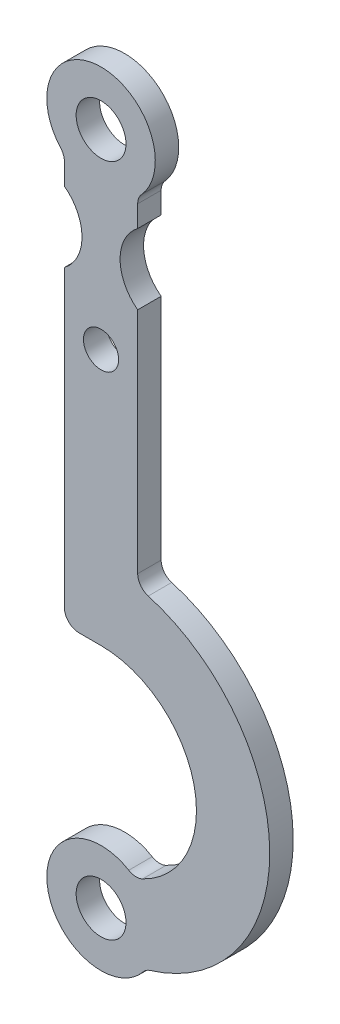
ISO-10303-21;
HEADER;
FILE_DESCRIPTION(('STEP AP214'),'2;1');
FILE_NAME('part.step','',(''),(''),'','','');
FILE_SCHEMA(('AUTOMOTIVE_DESIGN { 1 0 10303 214 1 1 1 1 }'));
ENDSEC;
DATA;
#1=APPLICATION_CONTEXT('core data for automotive mechanical design processes');
#2=APPLICATION_PROTOCOL_DEFINITION('international standard','automotive_design',2000,#1);
#3=PRODUCT_CONTEXT('',#1,'mechanical');
#4=PRODUCT('Part','Part','',(#3));
#5=PRODUCT_RELATED_PRODUCT_CATEGORY('part','',(#4));
#6=PRODUCT_DEFINITION_FORMATION('','',#4);
#7=PRODUCT_DEFINITION_CONTEXT('part definition',#1,'design');
#8=PRODUCT_DEFINITION('design','',#6,#7);
#9=PRODUCT_DEFINITION_SHAPE('','',#8);
#10=(LENGTH_UNIT() NAMED_UNIT(*) SI_UNIT(.MILLI.,.METRE.));
#11=(NAMED_UNIT(*) PLANE_ANGLE_UNIT() SI_UNIT($,.RADIAN.));
#12=(NAMED_UNIT(*) SI_UNIT($,.STERADIAN.) SOLID_ANGLE_UNIT());
#13=UNCERTAINTY_MEASURE_WITH_UNIT(LENGTH_MEASURE(1.E-05),#10,'distance_accuracy_value','');
#14=(GEOMETRIC_REPRESENTATION_CONTEXT(3) GLOBAL_UNCERTAINTY_ASSIGNED_CONTEXT((#13)) GLOBAL_UNIT_ASSIGNED_CONTEXT((#10,
#11,#12)) REPRESENTATION_CONTEXT('',''));
#15=CARTESIAN_POINT('',(0.,0.,0.));
#16=DIRECTION('',(0.,0.,1.));
#17=DIRECTION('',(1.,0.,0.));
#18=AXIS2_PLACEMENT_3D('',#15,#16,#17);
#19=CARTESIAN_POINT('',(0.,-230.,8.));
#20=DIRECTION('',(0.,0.,-1.));
#21=DIRECTION('',(-1.,0.,0.));
#22=AXIS2_PLACEMENT_3D('',#19,#20,#21);
#23=CYLINDRICAL_SURFACE('',#22,18.5);
#24=CARTESIAN_POINT('',(0.,-230.,0.));
#25=DIRECTION('',(0.,0.,1.));
#26=DIRECTION('',(1.,0.,0.));
#27=AXIS2_PLACEMENT_3D('',#24,#25,#26);
#28=CIRCLE('',#27,18.5);
#29=CARTESIAN_POINT('',(9.44463891587366,-214.092492472145,0.));
#30=VERTEX_POINT('',#29);
#31=CARTESIAN_POINT('',(14.3530284553606,-241.672213764304,0.));
#32=VERTEX_POINT('',#31);
#33=EDGE_CURVE('E236',#30,#32,#28,.T.);
#34=ORIENTED_EDGE('',*,*,#33,.T.);
#35=DIRECTION('',(0.,0.,-1.));
#36=VECTOR('',#35,1.);
#37=CARTESIAN_POINT('',(14.3530284553606,-241.672213764304,8.));
#38=LINE('',#37,#36);
#39=CARTESIAN_POINT('',(14.3530284553606,-241.672213764304,8.));
#40=VERTEX_POINT('',#39);
#41=EDGE_CURVE('E283',#32,#40,#38,.F.);
#42=ORIENTED_EDGE('',*,*,#41,.T.);
#43=CARTESIAN_POINT('',(0.,-230.,8.));
#44=DIRECTION('',(0.,0.,1.));
#45=DIRECTION('',(1.,0.,0.));
#46=AXIS2_PLACEMENT_3D('',#43,#44,#45);
#47=CIRCLE('',#46,18.5);
#48=CARTESIAN_POINT('',(9.44463891587366,-214.092492472145,8.));
#49=VERTEX_POINT('',#48);
#50=EDGE_CURVE('E409',#49,#40,#47,.T.);
#51=ORIENTED_EDGE('',*,*,#50,.F.);
#52=DIRECTION('',(0.,0.,-1.));
#53=VECTOR('',#52,1.);
#54=CARTESIAN_POINT('',(9.44463891587366,-214.092492472145,8.));
#55=LINE('',#54,#53);
#56=EDGE_CURVE('E280',#49,#30,#55,.T.);
#57=ORIENTED_EDGE('',*,*,#56,.T.);
#58=EDGE_LOOP('',(#34,#42,#51,#57));
#59=FACE_BOUND('',#58,.T.);
#60=ADVANCED_FACE('F51',(#59),#23,.T.);
#61=CARTESIAN_POINT('',(0.,-185.,8.));
#62=DIRECTION('',(0.,0.,-1.));
#63=DIRECTION('',(-1.,0.,0.));
#64=AXIS2_PLACEMENT_3D('',#61,#62,#63);
#65=CYLINDRICAL_SURFACE('',#64,57.5433285968466);
#66=CARTESIAN_POINT('',(0.,-185.,8.));
#67=DIRECTION('',(0.,0.,1.));
#68=DIRECTION('',(1.,0.,0.));
#69=AXIS2_PLACEMENT_3D('',#66,#67,#68);
#70=CIRCLE('',#69,57.5433285968466);
#71=CARTESIAN_POINT('',(16.7746577780857,-240.044032577862,8.));
#72=VERTEX_POINT('',#71);
#73=CARTESIAN_POINT('',(16.1009698881871,-129.755150152577,8.));
#74=VERTEX_POINT('',#73);
#75=EDGE_CURVE('E197',#72,#74,#70,.T.);
#76=ORIENTED_EDGE('',*,*,#75,.F.);
#77=DIRECTION('',(0.,0.,-1.));
#78=VECTOR('',#77,1.);
#79=CARTESIAN_POINT('',(16.7746577780857,-240.044032577862,8.));
#80=LINE('',#79,#78);
#81=CARTESIAN_POINT('',(16.7746577780857,-240.044032577862,0.));
#82=VERTEX_POINT('',#81);
#83=EDGE_CURVE('E277',#72,#82,#80,.T.);
#84=ORIENTED_EDGE('',*,*,#83,.T.);
#85=CARTESIAN_POINT('',(0.,-185.,0.));
#86=DIRECTION('',(0.,0.,1.));
#87=DIRECTION('',(1.,0.,0.));
#88=AXIS2_PLACEMENT_3D('',#85,#86,#87);
#89=CIRCLE('',#88,57.5433285968466);
#90=CARTESIAN_POINT('',(16.1009698881871,-129.755150152577,0.));
#91=VERTEX_POINT('',#90);
#92=EDGE_CURVE('E239',#82,#91,#89,.T.);
#93=ORIENTED_EDGE('',*,*,#92,.T.);
#94=DIRECTION('',(0.,0.,-1.));
#95=VECTOR('',#94,1.);
#96=CARTESIAN_POINT('',(16.1009698881871,-129.755150152577,8.));
#97=LINE('',#96,#95);
#98=EDGE_CURVE('E187',#91,#74,#97,.F.);
#99=ORIENTED_EDGE('',*,*,#98,.T.);
#100=EDGE_LOOP('',(#76,#84,#93,#99));
#101=FACE_BOUND('',#100,.T.);
#102=ADVANCED_FACE('F327',(#101),#65,.T.);
#103=CARTESIAN_POINT('',(12.5,0.,8.));
#104=DIRECTION('',(1.,0.,0.));
#105=DIRECTION('',(0.,1.,0.));
#106=AXIS2_PLACEMENT_3D('',#103,#104,#105);
#107=PLANE('',#106);
#108=DIRECTION('',(0.,-1.,0.));
#109=VECTOR('',#108,1.);
#110=CARTESIAN_POINT('',(12.5,0.,8.));
#111=LINE('',#110,#109);
#112=CARTESIAN_POINT('',(12.5,-47.,8.));
#113=VERTEX_POINT('',#112);
#114=CARTESIAN_POINT('',(12.5,-124.954867374839,8.));
#115=VERTEX_POINT('',#114);
#116=EDGE_CURVE('E179',#113,#115,#111,.T.);
#117=ORIENTED_EDGE('',*,*,#116,.T.);
#118=DIRECTION('',(0.,0.,-1.));
#119=VECTOR('',#118,1.);
#120=CARTESIAN_POINT('',(12.5,-124.954867374839,8.));
#121=LINE('',#120,#119);
#122=CARTESIAN_POINT('',(12.5,-124.954867374839,0.));
#123=VERTEX_POINT('',#122);
#124=EDGE_CURVE('E297',#115,#123,#121,.T.);
#125=ORIENTED_EDGE('',*,*,#124,.T.);
#126=DIRECTION('',(0.,-1.,0.));
#127=VECTOR('',#126,1.);
#128=CARTESIAN_POINT('',(12.5,0.,0.));
#129=LINE('',#128,#127);
#130=CARTESIAN_POINT('',(12.5,-47.,0.));
#131=VERTEX_POINT('',#130);
#132=EDGE_CURVE('E182',#131,#123,#129,.T.);
#133=ORIENTED_EDGE('',*,*,#132,.F.);
#134=DIRECTION('',(0.,0.,-1.));
#135=VECTOR('',#134,1.);
#136=CARTESIAN_POINT('',(12.5,-47.,8.));
#137=LINE('',#136,#135);
#138=EDGE_CURVE('E175',#113,#131,#137,.T.);
#139=ORIENTED_EDGE('',*,*,#138,.F.);
#140=EDGE_LOOP('',(#117,#125,#133,#139));
#141=FACE_BOUND('',#140,.T.);
#142=ADVANCED_FACE('F177',(#141),#107,.T.);
#143=CARTESIAN_POINT('',(21.5,-35.,8.));
#144=DIRECTION('',(0.,0.,-1.));
#145=DIRECTION('',(-1.,0.,0.));
#146=AXIS2_PLACEMENT_3D('',#143,#144,#145);
#147=CYLINDRICAL_SURFACE('',#146,15.);
#148=CARTESIAN_POINT('',(21.5,-35.,0.));
#149=DIRECTION('',(0.,0.,1.));
#150=DIRECTION('',(1.,0.,0.));
#151=AXIS2_PLACEMENT_3D('',#148,#149,#150);
#152=CIRCLE('',#151,15.);
#153=CARTESIAN_POINT('',(12.5,-23.,0.));
#154=VERTEX_POINT('',#153);
#155=EDGE_CURVE('E243',#154,#131,#152,.T.);
#156=ORIENTED_EDGE('',*,*,#155,.F.);
#157=DIRECTION('',(0.,0.,-1.));
#158=VECTOR('',#157,1.);
#159=CARTESIAN_POINT('',(12.5,-23.,8.));
#160=LINE('',#159,#158);
#161=CARTESIAN_POINT('',(12.5,-23.,8.));
#162=VERTEX_POINT('',#161);
#163=EDGE_CURVE('E188',#162,#154,#160,.T.);
#164=ORIENTED_EDGE('',*,*,#163,.F.);
#165=CARTESIAN_POINT('',(21.5,-35.,8.));
#166=DIRECTION('',(0.,0.,1.));
#167=DIRECTION('',(1.,0.,0.));
#168=AXIS2_PLACEMENT_3D('',#165,#166,#167);
#169=CIRCLE('',#168,15.);
#170=EDGE_CURVE('E194',#162,#113,#169,.T.);
#171=ORIENTED_EDGE('',*,*,#170,.T.);
#172=ORIENTED_EDGE('',*,*,#138,.T.);
#173=EDGE_LOOP('',(#156,#164,#171,#172));
#174=FACE_BOUND('',#173,.T.);
#175=ADVANCED_FACE('F200',(#174),#147,.F.);
#176=CARTESIAN_POINT('',(12.5,0.,8.));
#177=DIRECTION('',(1.,0.,0.));
#178=DIRECTION('',(0.,1.,0.));
#179=AXIS2_PLACEMENT_3D('',#176,#177,#178);
#180=PLANE('',#179);
#181=DIRECTION('',(0.,-1.,0.));
#182=VECTOR('',#181,1.);
#183=CARTESIAN_POINT('',(12.5,0.,0.));
#184=LINE('',#183,#182);
#185=CARTESIAN_POINT('',(12.5,-15.6843871413581,0.));
#186=VERTEX_POINT('',#185);
#187=EDGE_CURVE('E246',#186,#154,#184,.T.);
#188=ORIENTED_EDGE('',*,*,#187,.F.);
#189=DIRECTION('',(0.,0.,1.));
#190=VECTOR('',#189,1.);
#191=CARTESIAN_POINT('',(12.5,-15.6843871413581,8.));
#192=LINE('',#191,#190);
#193=CARTESIAN_POINT('',(12.5,-15.6843871413581,8.));
#194=VERTEX_POINT('',#193);
#195=EDGE_CURVE('E292',#186,#194,#192,.T.);
#196=ORIENTED_EDGE('',*,*,#195,.T.);
#197=DIRECTION('',(0.,-1.,0.));
#198=VECTOR('',#197,1.);
#199=CARTESIAN_POINT('',(12.5,0.,8.));
#200=LINE('',#199,#198);
#201=EDGE_CURVE('E203',#194,#162,#200,.T.);
#202=ORIENTED_EDGE('',*,*,#201,.T.);
#203=ORIENTED_EDGE('',*,*,#163,.T.);
#204=EDGE_LOOP('',(#188,#196,#202,#203));
#205=FACE_BOUND('',#204,.T.);
#206=ADVANCED_FACE('F452',(#205),#180,.T.);
#207=CARTESIAN_POINT('',(0.,0.,8.));
#208=DIRECTION('',(0.,0.,-1.));
#209=DIRECTION('',(-1.,0.,0.));
#210=AXIS2_PLACEMENT_3D('',#207,#208,#209);
#211=CYLINDRICAL_SURFACE('',#210,18.5);
#212=CARTESIAN_POINT('',(0.,0.,8.));
#213=DIRECTION('',(0.,0.,1.));
#214=DIRECTION('',(1.,0.,0.));
#215=AXIS2_PLACEMENT_3D('',#212,#213,#214);
#216=CIRCLE('',#215,18.5);
#217=CARTESIAN_POINT('',(-13.7765957446809,-12.3472834942607,8.));
#218=VERTEX_POINT('',#217);
#219=CARTESIAN_POINT('',(13.7765957446809,-12.3472834942607,8.));
#220=VERTEX_POINT('',#219);
#221=EDGE_CURVE('E207',#218,#220,#216,.F.);
#222=ORIENTED_EDGE('',*,*,#221,.T.);
#223=DIRECTION('',(0.,0.,-1.));
#224=VECTOR('',#223,1.);
#225=CARTESIAN_POINT('',(13.7765957446809,-12.3472834942607,8.));
#226=LINE('',#225,#224);
#227=CARTESIAN_POINT('',(13.7765957446809,-12.3472834942607,0.));
#228=VERTEX_POINT('',#227);
#229=EDGE_CURVE('E289',#220,#228,#226,.T.);
#230=ORIENTED_EDGE('',*,*,#229,.T.);
#231=CARTESIAN_POINT('',(0.,0.,0.));
#232=DIRECTION('',(0.,0.,1.));
#233=DIRECTION('',(1.,0.,0.));
#234=AXIS2_PLACEMENT_3D('',#231,#232,#233);
#235=CIRCLE('',#234,18.5);
#236=CARTESIAN_POINT('',(-13.7765957446809,-12.3472834942607,0.));
#237=VERTEX_POINT('',#236);
#238=EDGE_CURVE('E248',#237,#228,#235,.F.);
#239=ORIENTED_EDGE('',*,*,#238,.F.);
#240=DIRECTION('',(0.,0.,-1.));
#241=VECTOR('',#240,1.);
#242=CARTESIAN_POINT('',(-13.7765957446809,-12.3472834942607,8.));
#243=LINE('',#242,#241);
#244=EDGE_CURVE('E287',#237,#218,#243,.F.);
#245=ORIENTED_EDGE('',*,*,#244,.T.);
#246=EDGE_LOOP('',(#222,#230,#239,#245));
#247=FACE_BOUND('',#246,.T.);
#248=ADVANCED_FACE('F381',(#247),#211,.T.);
#249=CARTESIAN_POINT('',(-12.5,0.,8.));
#250=DIRECTION('',(1.,0.,0.));
#251=DIRECTION('',(0.,1.,0.));
#252=AXIS2_PLACEMENT_3D('',#249,#250,#251);
#253=PLANE('',#252);
#254=DIRECTION('',(0.,-1.,0.));
#255=VECTOR('',#254,1.);
#256=CARTESIAN_POINT('',(-12.5,0.,8.));
#257=LINE('',#256,#255);
#258=CARTESIAN_POINT('',(-12.5,-15.6843871413581,8.));
#259=VERTEX_POINT('',#258);
#260=CARTESIAN_POINT('',(-12.5,-23.,8.));
#261=VERTEX_POINT('',#260);
#262=EDGE_CURVE('E213',#259,#261,#257,.T.);
#263=ORIENTED_EDGE('',*,*,#262,.F.);
#264=DIRECTION('',(0.,0.,-1.));
#265=VECTOR('',#264,1.);
#266=CARTESIAN_POINT('',(-12.5,-15.6843871413581,8.));
#267=LINE('',#266,#265);
#268=CARTESIAN_POINT('',(-12.5,-15.6843871413581,0.));
#269=VERTEX_POINT('',#268);
#270=EDGE_CURVE('E294',#259,#269,#267,.T.);
#271=ORIENTED_EDGE('',*,*,#270,.T.);
#272=DIRECTION('',(0.,-1.,0.));
#273=VECTOR('',#272,1.);
#274=CARTESIAN_POINT('',(-12.5,0.,0.));
#275=LINE('',#274,#273);
#276=CARTESIAN_POINT('',(-12.5,-23.,0.));
#277=VERTEX_POINT('',#276);
#278=EDGE_CURVE('E251',#269,#277,#275,.T.);
#279=ORIENTED_EDGE('',*,*,#278,.T.);
#280=DIRECTION('',(0.,0.,-1.));
#281=VECTOR('',#280,1.);
#282=CARTESIAN_POINT('',(-12.5,-23.,8.));
#283=LINE('',#282,#281);
#284=EDGE_CURVE('E271',#261,#277,#283,.T.);
#285=ORIENTED_EDGE('',*,*,#284,.F.);
#286=EDGE_LOOP('',(#263,#271,#279,#285));
#287=FACE_BOUND('',#286,.T.);
#288=ADVANCED_FACE('F388',(#287),#253,.F.);
#289=CARTESIAN_POINT('',(-21.5,-35.,8.));
#290=DIRECTION('',(0.,0.,-1.));
#291=DIRECTION('',(-1.,0.,0.));
#292=AXIS2_PLACEMENT_3D('',#289,#290,#291);
#293=CYLINDRICAL_SURFACE('',#292,15.);
#294=CARTESIAN_POINT('',(-21.5,-35.,0.));
#295=DIRECTION('',(0.,0.,1.));
#296=DIRECTION('',(1.,0.,0.));
#297=AXIS2_PLACEMENT_3D('',#294,#295,#296);
#298=CIRCLE('',#297,15.);
#299=CARTESIAN_POINT('',(-12.5,-47.,0.));
#300=VERTEX_POINT('',#299);
#301=EDGE_CURVE('E254',#277,#300,#298,.F.);
#302=ORIENTED_EDGE('',*,*,#301,.T.);
#303=DIRECTION('',(0.,0.,-1.));
#304=VECTOR('',#303,1.);
#305=CARTESIAN_POINT('',(-12.5,-47.,8.));
#306=LINE('',#305,#304);
#307=CARTESIAN_POINT('',(-12.5,-47.,8.));
#308=VERTEX_POINT('',#307);
#309=EDGE_CURVE('E267',#308,#300,#306,.T.);
#310=ORIENTED_EDGE('',*,*,#309,.F.);
#311=CARTESIAN_POINT('',(-21.5,-35.,8.));
#312=DIRECTION('',(0.,0.,1.));
#313=DIRECTION('',(1.,0.,0.));
#314=AXIS2_PLACEMENT_3D('',#311,#312,#313);
#315=CIRCLE('',#314,15.);
#316=EDGE_CURVE('E215',#261,#308,#315,.F.);
#317=ORIENTED_EDGE('',*,*,#316,.F.);
#318=ORIENTED_EDGE('',*,*,#284,.T.);
#319=EDGE_LOOP('',(#302,#310,#317,#318));
#320=FACE_BOUND('',#319,.T.);
#321=ADVANCED_FACE('F394',(#320),#293,.F.);
#322=CARTESIAN_POINT('',(-12.5,0.,8.));
#323=DIRECTION('',(1.,0.,0.));
#324=DIRECTION('',(0.,1.,0.));
#325=AXIS2_PLACEMENT_3D('',#322,#323,#324);
#326=PLANE('',#325);
#327=DIRECTION('',(0.,-1.,0.));
#328=VECTOR('',#327,1.);
#329=CARTESIAN_POINT('',(-12.5,0.,0.));
#330=LINE('',#329,#328);
#331=CARTESIAN_POINT('',(-12.5,-147.456671403153,0.));
#332=VERTEX_POINT('',#331);
#333=EDGE_CURVE('E257',#300,#332,#330,.T.);
#334=ORIENTED_EDGE('',*,*,#333,.T.);
#335=DIRECTION('',(0.,0.,-1.));
#336=VECTOR('',#335,1.);
#337=CARTESIAN_POINT('',(-12.5,-147.456671403153,8.));
#338=LINE('',#337,#336);
#339=CARTESIAN_POINT('',(-12.5,-147.456671403153,8.));
#340=VERTEX_POINT('',#339);
#341=EDGE_CURVE('E66',#332,#340,#338,.F.);
#342=ORIENTED_EDGE('',*,*,#341,.T.);
#343=DIRECTION('',(0.,-1.,0.));
#344=VECTOR('',#343,1.);
#345=CARTESIAN_POINT('',(-12.5,0.,8.));
#346=LINE('',#345,#344);
#347=EDGE_CURVE('E218',#308,#340,#346,.T.);
#348=ORIENTED_EDGE('',*,*,#347,.F.);
#349=ORIENTED_EDGE('',*,*,#309,.T.);
#350=EDGE_LOOP('',(#334,#342,#348,#349));
#351=FACE_BOUND('',#350,.T.);
#352=ADVANCED_FACE('F443',(#351),#326,.F.);
#353=CARTESIAN_POINT('',(0.,-152.456671403153,8.));
#354=DIRECTION('',(0.,-1.,0.));
#355=DIRECTION('',(0.,0.,-1.));
#356=AXIS2_PLACEMENT_3D('',#353,#354,#355);
#357=PLANE('',#356);
#358=DIRECTION('',(-1.,0.,0.));
#359=VECTOR('',#358,1.);
#360=CARTESIAN_POINT('',(0.,-152.456671403153,8.));
#361=LINE('',#360,#359);
#362=CARTESIAN_POINT('',(0.,-152.456671403153,8.));
#363=VERTEX_POINT('',#362);
#364=CARTESIAN_POINT('',(-7.49999999999999,-152.456671403153,8.));
#365=VERTEX_POINT('',#364);
#366=EDGE_CURVE('E220',#363,#365,#361,.T.);
#367=ORIENTED_EDGE('',*,*,#366,.T.);
#368=DIRECTION('',(0.,0.,-1.));
#369=VECTOR('',#368,1.);
#370=CARTESIAN_POINT('',(-7.49999999999999,-152.456671403153,0.));
#371=LINE('',#370,#369);
#372=CARTESIAN_POINT('',(-7.49999999999999,-152.456671403153,0.));
#373=VERTEX_POINT('',#372);
#374=EDGE_CURVE('E299',#365,#373,#371,.T.);
#375=ORIENTED_EDGE('',*,*,#374,.T.);
#376=DIRECTION('',(-1.,0.,0.));
#377=VECTOR('',#376,1.);
#378=CARTESIAN_POINT('',(0.,-152.456671403153,0.));
#379=LINE('',#378,#377);
#380=CARTESIAN_POINT('',(0.,-152.456671403153,0.));
#381=VERTEX_POINT('',#380);
#382=EDGE_CURVE('E260',#381,#373,#379,.T.);
#383=ORIENTED_EDGE('',*,*,#382,.F.);
#384=DIRECTION('',(0.,0.,-1.));
#385=VECTOR('',#384,1.);
#386=CARTESIAN_POINT('',(0.,-152.456671403153,8.));
#387=LINE('',#386,#385);
#388=EDGE_CURVE('E226',#363,#381,#387,.T.);
#389=ORIENTED_EDGE('',*,*,#388,.F.);
#390=EDGE_LOOP('',(#367,#375,#383,#389));
#391=FACE_BOUND('',#390,.T.);
#392=ADVANCED_FACE('F354',(#391),#357,.T.);
#393=CARTESIAN_POINT('',(0.,0.,8.));
#394=DIRECTION('',(0.,0.,-1.));
#395=DIRECTION('',(-1.,0.,0.));
#396=AXIS2_PLACEMENT_3D('',#393,#394,#395);
#397=CYLINDRICAL_SURFACE('',#396,8.5);
#398=CARTESIAN_POINT('',(0.,0.,8.));
#399=DIRECTION('',(0.,0.,1.));
#400=DIRECTION('',(1.,0.,0.));
#401=AXIS2_PLACEMENT_3D('',#398,#399,#400);
#402=CIRCLE('',#401,8.5);
#403=CARTESIAN_POINT('',(8.5,0.,8.));
#404=VERTEX_POINT('',#403);
#405=EDGE_CURVE('E412',#404,#404,#402,.T.);
#406=ORIENTED_EDGE('',*,*,#405,.T.);
#407=EDGE_LOOP('',(#406));
#408=FACE_BOUND('',#407,.T.);
#409=CARTESIAN_POINT('',(0.,0.,0.));
#410=DIRECTION('',(0.,0.,1.));
#411=DIRECTION('',(1.,0.,0.));
#412=AXIS2_PLACEMENT_3D('',#409,#410,#411);
#413=CIRCLE('',#412,8.5);
#414=CARTESIAN_POINT('',(8.5,0.,0.));
#415=VERTEX_POINT('',#414);
#416=EDGE_CURVE('E233',#415,#415,#413,.T.);
#417=ORIENTED_EDGE('',*,*,#416,.F.);
#418=EDGE_LOOP('',(#417));
#419=FACE_BOUND('',#418,.T.);
#420=ADVANCED_FACE('F350',(#408,#419),#397,.F.);
#421=CARTESIAN_POINT('',(0.,-230.,8.));
#422=DIRECTION('',(0.,0.,-1.));
#423=DIRECTION('',(-1.,0.,0.));
#424=AXIS2_PLACEMENT_3D('',#421,#422,#423);
#425=CYLINDRICAL_SURFACE('',#424,8.50000000000001);
#426=CARTESIAN_POINT('',(0.,-230.,8.));
#427=DIRECTION('',(0.,0.,1.));
#428=DIRECTION('',(1.,0.,0.));
#429=AXIS2_PLACEMENT_3D('',#426,#427,#428);
#430=CIRCLE('',#429,8.50000000000001);
#431=CARTESIAN_POINT('',(8.50000000000001,-230.,8.));
#432=VERTEX_POINT('',#431);
#433=EDGE_CURVE('E415',#432,#432,#430,.T.);
#434=ORIENTED_EDGE('',*,*,#433,.T.);
#435=EDGE_LOOP('',(#434));
#436=FACE_BOUND('',#435,.T.);
#437=CARTESIAN_POINT('',(0.,-230.,0.));
#438=DIRECTION('',(0.,0.,1.));
#439=DIRECTION('',(1.,0.,0.));
#440=AXIS2_PLACEMENT_3D('',#437,#438,#439);
#441=CIRCLE('',#440,8.50000000000001);
#442=CARTESIAN_POINT('',(8.50000000000001,-230.,0.));
#443=VERTEX_POINT('',#442);
#444=EDGE_CURVE('E230',#443,#443,#441,.T.);
#445=ORIENTED_EDGE('',*,*,#444,.F.);
#446=EDGE_LOOP('',(#445));
#447=FACE_BOUND('',#446,.T.);
#448=ADVANCED_FACE('F353',(#436,#447),#425,.F.);
#449=CARTESIAN_POINT('',(0.,-65.,8.));
#450=DIRECTION('',(0.,0.,-1.));
#451=DIRECTION('',(-1.,0.,0.));
#452=AXIS2_PLACEMENT_3D('',#449,#450,#451);
#453=CYLINDRICAL_SURFACE('',#452,6.);
#454=CARTESIAN_POINT('',(0.,-65.,8.));
#455=DIRECTION('',(0.,0.,1.));
#456=DIRECTION('',(1.,0.,0.));
#457=AXIS2_PLACEMENT_3D('',#454,#455,#456);
#458=CIRCLE('',#457,6.);
#459=CARTESIAN_POINT('',(6.,-65.,8.));
#460=VERTEX_POINT('',#459);
#461=EDGE_CURVE('E265',#460,#460,#458,.T.);
#462=ORIENTED_EDGE('',*,*,#461,.T.);
#463=EDGE_LOOP('',(#462));
#464=FACE_BOUND('',#463,.T.);
#465=CARTESIAN_POINT('',(0.,-65.,0.));
#466=DIRECTION('',(0.,0.,1.));
#467=DIRECTION('',(1.,0.,0.));
#468=AXIS2_PLACEMENT_3D('',#465,#466,#467);
#469=CIRCLE('',#468,6.);
#470=CARTESIAN_POINT('',(6.,-65.,0.));
#471=VERTEX_POINT('',#470);
#472=EDGE_CURVE('E227',#471,#471,#469,.T.);
#473=ORIENTED_EDGE('',*,*,#472,.F.);
#474=EDGE_LOOP('',(#473));
#475=FACE_BOUND('',#474,.T.);
#476=ADVANCED_FACE('F358',(#464,#475),#453,.F.);
#477=CARTESIAN_POINT('',(0.,-185.,8.));
#478=DIRECTION('',(0.,0.,-1.));
#479=DIRECTION('',(-1.,0.,0.));
#480=AXIS2_PLACEMENT_3D('',#477,#478,#479);
#481=CYLINDRICAL_SURFACE('',#480,32.5433285968467);
#482=CARTESIAN_POINT('',(0.,-185.,0.));
#483=DIRECTION('',(0.,0.,1.));
#484=DIRECTION('',(1.,0.,0.));
#485=AXIS2_PLACEMENT_3D('',#482,#483,#484);
#486=CIRCLE('',#485,32.5433285968467);
#487=CARTESIAN_POINT('',(14.1751296796172,-214.293923170657,0.));
#488=VERTEX_POINT('',#487);
#489=EDGE_CURVE('E262',#381,#488,#486,.F.);
#490=ORIENTED_EDGE('',*,*,#489,.T.);
#491=DIRECTION('',(0.,0.,-1.));
#492=VECTOR('',#491,1.);
#493=CARTESIAN_POINT('',(14.1751296796172,-214.293923170657,8.));
#494=LINE('',#493,#492);
#495=CARTESIAN_POINT('',(14.1751296796172,-214.293923170657,8.));
#496=VERTEX_POINT('',#495);
#497=EDGE_CURVE('E285',#488,#496,#494,.F.);
#498=ORIENTED_EDGE('',*,*,#497,.T.);
#499=CARTESIAN_POINT('',(0.,-185.,8.));
#500=DIRECTION('',(0.,0.,1.));
#501=DIRECTION('',(1.,0.,0.));
#502=AXIS2_PLACEMENT_3D('',#499,#500,#501);
#503=CIRCLE('',#502,32.5433285968467);
#504=EDGE_CURVE('E223',#363,#496,#503,.F.);
#505=ORIENTED_EDGE('',*,*,#504,.F.);
#506=ORIENTED_EDGE('',*,*,#388,.T.);
#507=EDGE_LOOP('',(#490,#498,#505,#506));
#508=FACE_BOUND('',#507,.T.);
#509=ADVANCED_FACE('F361',(#508),#481,.F.);
#510=CARTESIAN_POINT('',(0.,0.,8.));
#511=DIRECTION('',(0.,0.,1.));
#512=DIRECTION('',(1.,0.,0.));
#513=AXIS2_PLACEMENT_3D('',#510,#511,#512);
#514=PLANE('',#513);
#515=ORIENTED_EDGE('',*,*,#461,.F.);
#516=EDGE_LOOP('',(#515));
#517=FACE_BOUND('',#516,.T.);
#518=ORIENTED_EDGE('',*,*,#433,.F.);
#519=EDGE_LOOP('',(#518));
#520=FACE_BOUND('',#519,.T.);
#521=ORIENTED_EDGE('',*,*,#405,.F.);
#522=EDGE_LOOP('',(#521));
#523=FACE_BOUND('',#522,.T.);
#524=ORIENTED_EDGE('',*,*,#347,.T.);
#525=CARTESIAN_POINT('',(-7.49999999999999,-147.456671403153,8.));
#526=DIRECTION('',(0.,0.,1.));
#527=DIRECTION('',(1.,0.,0.));
#528=AXIS2_PLACEMENT_3D('',#525,#526,#527);
#529=CIRCLE('',#528,5.);
#530=EDGE_CURVE('E304',#340,#365,#529,.T.);
#531=ORIENTED_EDGE('',*,*,#530,.T.);
#532=ORIENTED_EDGE('',*,*,#366,.F.);
#533=ORIENTED_EDGE('',*,*,#504,.T.);
#534=CARTESIAN_POINT('',(11.997244028272,-209.793166113265,8.));
#535=DIRECTION('',(0.,0.,1.));
#536=DIRECTION('',(1.,0.,0.));
#537=AXIS2_PLACEMENT_3D('',#534,#535,#536);
#538=CIRCLE('',#537,5.);
#539=EDGE_CURVE('E312',#496,#49,#538,.F.);
#540=ORIENTED_EDGE('',*,*,#539,.T.);
#541=ORIENTED_EDGE('',*,*,#50,.T.);
#542=CARTESIAN_POINT('',(18.2322253351878,-244.826866133035,8.));
#543=DIRECTION('',(0.,0.,1.));
#544=DIRECTION('',(1.,0.,0.));
#545=AXIS2_PLACEMENT_3D('',#542,#543,#544);
#546=CIRCLE('',#545,5.);
#547=EDGE_CURVE('E308',#40,#72,#546,.F.);
#548=ORIENTED_EDGE('',*,*,#547,.T.);
#549=ORIENTED_EDGE('',*,*,#75,.T.);
#550=CARTESIAN_POINT('',(17.5,-124.954867374839,8.));
#551=DIRECTION('',(0.,0.,1.));
#552=DIRECTION('',(1.,0.,0.));
#553=AXIS2_PLACEMENT_3D('',#550,#551,#552);
#554=CIRCLE('',#553,5.);
#555=EDGE_CURVE('E11',#74,#115,#554,.F.);
#556=ORIENTED_EDGE('',*,*,#555,.T.);
#557=ORIENTED_EDGE('',*,*,#116,.F.);
#558=ORIENTED_EDGE('',*,*,#170,.F.);
#559=ORIENTED_EDGE('',*,*,#201,.F.);
#560=CARTESIAN_POINT('',(17.5,-15.6843871413581,8.));
#561=DIRECTION('',(0.,0.,1.));
#562=DIRECTION('',(1.,0.,0.));
#563=AXIS2_PLACEMENT_3D('',#560,#561,#562);
#564=CIRCLE('',#563,5.);
#565=EDGE_CURVE('E316',#194,#220,#564,.F.);
#566=ORIENTED_EDGE('',*,*,#565,.T.);
#567=ORIENTED_EDGE('',*,*,#221,.F.);
#568=CARTESIAN_POINT('',(-17.5,-15.6843871413581,8.));
#569=DIRECTION('',(0.,0.,1.));
#570=DIRECTION('',(1.,0.,0.));
#571=AXIS2_PLACEMENT_3D('',#568,#569,#570);
#572=CIRCLE('',#571,5.);
#573=EDGE_CURVE('E320',#218,#259,#572,.F.);
#574=ORIENTED_EDGE('',*,*,#573,.T.);
#575=ORIENTED_EDGE('',*,*,#262,.T.);
#576=ORIENTED_EDGE('',*,*,#316,.T.);
#577=EDGE_LOOP('',(#524,#531,#532,#533,#540,#541,#548,#549,#556,#557,#558,#559,#566,#567,#574,
#575,#576));
#578=FACE_BOUND('',#577,.T.);
#579=ADVANCED_FACE('F192',(#517,#520,#523,#578),#514,.T.);
#580=CARTESIAN_POINT('',(0.,0.,0.));
#581=DIRECTION('',(0.,0.,1.));
#582=DIRECTION('',(1.,0.,0.));
#583=AXIS2_PLACEMENT_3D('',#580,#581,#582);
#584=PLANE('',#583);
#585=ORIENTED_EDGE('',*,*,#472,.T.);
#586=EDGE_LOOP('',(#585));
#587=FACE_BOUND('',#586,.T.);
#588=ORIENTED_EDGE('',*,*,#444,.T.);
#589=EDGE_LOOP('',(#588));
#590=FACE_BOUND('',#589,.T.);
#591=ORIENTED_EDGE('',*,*,#416,.T.);
#592=EDGE_LOOP('',(#591));
#593=FACE_BOUND('',#592,.T.);
#594=ORIENTED_EDGE('',*,*,#382,.T.);
#595=CARTESIAN_POINT('',(-7.49999999999999,-147.456671403153,0.));
#596=DIRECTION('',(0.,0.,1.));
#597=DIRECTION('',(1.,0.,0.));
#598=AXIS2_PLACEMENT_3D('',#595,#596,#597);
#599=CIRCLE('',#598,5.);
#600=EDGE_CURVE('E74',#373,#332,#599,.F.);
#601=ORIENTED_EDGE('',*,*,#600,.T.);
#602=ORIENTED_EDGE('',*,*,#333,.F.);
#603=ORIENTED_EDGE('',*,*,#301,.F.);
#604=ORIENTED_EDGE('',*,*,#278,.F.);
#605=CARTESIAN_POINT('',(-17.5,-15.6843871413581,0.));
#606=DIRECTION('',(0.,0.,1.));
#607=DIRECTION('',(1.,0.,0.));
#608=AXIS2_PLACEMENT_3D('',#605,#606,#607);
#609=CIRCLE('',#608,5.);
#610=EDGE_CURVE('E318',#269,#237,#609,.T.);
#611=ORIENTED_EDGE('',*,*,#610,.T.);
#612=ORIENTED_EDGE('',*,*,#238,.T.);
#613=CARTESIAN_POINT('',(17.5,-15.6843871413581,0.));
#614=DIRECTION('',(0.,0.,1.));
#615=DIRECTION('',(1.,0.,0.));
#616=AXIS2_PLACEMENT_3D('',#613,#614,#615);
#617=CIRCLE('',#616,5.);
#618=EDGE_CURVE('E314',#228,#186,#617,.T.);
#619=ORIENTED_EDGE('',*,*,#618,.T.);
#620=ORIENTED_EDGE('',*,*,#187,.T.);
#621=ORIENTED_EDGE('',*,*,#155,.T.);
#622=ORIENTED_EDGE('',*,*,#132,.T.);
#623=CARTESIAN_POINT('',(17.5,-124.954867374839,0.));
#624=DIRECTION('',(0.,0.,1.));
#625=DIRECTION('',(1.,0.,0.));
#626=AXIS2_PLACEMENT_3D('',#623,#624,#625);
#627=CIRCLE('',#626,5.);
#628=EDGE_CURVE('E59',#123,#91,#627,.T.);
#629=ORIENTED_EDGE('',*,*,#628,.T.);
#630=ORIENTED_EDGE('',*,*,#92,.F.);
#631=CARTESIAN_POINT('',(18.2322253351878,-244.826866133035,0.));
#632=DIRECTION('',(0.,0.,1.));
#633=DIRECTION('',(1.,0.,0.));
#634=AXIS2_PLACEMENT_3D('',#631,#632,#633);
#635=CIRCLE('',#634,5.);
#636=EDGE_CURVE('E306',#82,#32,#635,.T.);
#637=ORIENTED_EDGE('',*,*,#636,.T.);
#638=ORIENTED_EDGE('',*,*,#33,.F.);
#639=CARTESIAN_POINT('',(11.997244028272,-209.793166113265,0.));
#640=DIRECTION('',(0.,0.,1.));
#641=DIRECTION('',(1.,0.,0.));
#642=AXIS2_PLACEMENT_3D('',#639,#640,#641);
#643=CIRCLE('',#642,5.);
#644=EDGE_CURVE('E310',#30,#488,#643,.T.);
#645=ORIENTED_EDGE('',*,*,#644,.T.);
#646=ORIENTED_EDGE('',*,*,#489,.F.);
#647=EDGE_LOOP('',(#594,#601,#602,#603,#604,#611,#612,#619,#620,#621,#622,#629,#630,#637,#638,
#645,#646));
#648=FACE_BOUND('',#647,.T.);
#649=ADVANCED_FACE('F322',(#587,#590,#593,#648),#584,.F.);
#650=CARTESIAN_POINT('',(18.2322253351878,-244.826866133035,8.));
#651=DIRECTION('',(0.,0.,1.));
#652=DIRECTION('',(1.,0.,0.));
#653=AXIS2_PLACEMENT_3D('',#650,#651,#652);
#654=CYLINDRICAL_SURFACE('',#653,5.);
#655=ORIENTED_EDGE('',*,*,#547,.F.);
#656=ORIENTED_EDGE('',*,*,#41,.F.);
#657=ORIENTED_EDGE('',*,*,#636,.F.);
#658=ORIENTED_EDGE('',*,*,#83,.F.);
#659=EDGE_LOOP('',(#655,#656,#657,#658));
#660=FACE_BOUND('',#659,.T.);
#661=ADVANCED_FACE('F363',(#660),#654,.F.);
#662=CARTESIAN_POINT('',(11.997244028272,-209.793166113265,8.));
#663=DIRECTION('',(0.,0.,-1.));
#664=DIRECTION('',(-1.,0.,0.));
#665=AXIS2_PLACEMENT_3D('',#662,#663,#664);
#666=CYLINDRICAL_SURFACE('',#665,5.);
#667=ORIENTED_EDGE('',*,*,#539,.F.);
#668=ORIENTED_EDGE('',*,*,#497,.F.);
#669=ORIENTED_EDGE('',*,*,#644,.F.);
#670=ORIENTED_EDGE('',*,*,#56,.F.);
#671=EDGE_LOOP('',(#667,#668,#669,#670));
#672=FACE_BOUND('',#671,.T.);
#673=ADVANCED_FACE('F366',(#672),#666,.F.);
#674=CARTESIAN_POINT('',(17.5,-15.6843871413581,8.));
#675=DIRECTION('',(0.,0.,-1.));
#676=DIRECTION('',(-1.,0.,0.));
#677=AXIS2_PLACEMENT_3D('',#674,#675,#676);
#678=CYLINDRICAL_SURFACE('',#677,5.);
#679=ORIENTED_EDGE('',*,*,#565,.F.);
#680=ORIENTED_EDGE('',*,*,#195,.F.);
#681=ORIENTED_EDGE('',*,*,#618,.F.);
#682=ORIENTED_EDGE('',*,*,#229,.F.);
#683=EDGE_LOOP('',(#679,#680,#681,#682));
#684=FACE_BOUND('',#683,.T.);
#685=ADVANCED_FACE('F337',(#684),#678,.F.);
#686=CARTESIAN_POINT('',(-17.5,-15.6843871413581,8.));
#687=DIRECTION('',(0.,0.,-1.));
#688=DIRECTION('',(-1.,0.,0.));
#689=AXIS2_PLACEMENT_3D('',#686,#687,#688);
#690=CYLINDRICAL_SURFACE('',#689,5.);
#691=ORIENTED_EDGE('',*,*,#573,.F.);
#692=ORIENTED_EDGE('',*,*,#244,.F.);
#693=ORIENTED_EDGE('',*,*,#610,.F.);
#694=ORIENTED_EDGE('',*,*,#270,.F.);
#695=EDGE_LOOP('',(#691,#692,#693,#694));
#696=FACE_BOUND('',#695,.T.);
#697=ADVANCED_FACE('F331',(#696),#690,.F.);
#698=CARTESIAN_POINT('',(17.5,-124.954867374839,8.));
#699=DIRECTION('',(0.,0.,-1.));
#700=DIRECTION('',(-1.,0.,0.));
#701=AXIS2_PLACEMENT_3D('',#698,#699,#700);
#702=CYLINDRICAL_SURFACE('',#701,5.);
#703=ORIENTED_EDGE('',*,*,#555,.F.);
#704=ORIENTED_EDGE('',*,*,#98,.F.);
#705=ORIENTED_EDGE('',*,*,#628,.F.);
#706=ORIENTED_EDGE('',*,*,#124,.F.);
#707=EDGE_LOOP('',(#703,#704,#705,#706));
#708=FACE_BOUND('',#707,.T.);
#709=ADVANCED_FACE('F329',(#708),#702,.F.);
#710=CARTESIAN_POINT('',(-7.49999999999999,-147.456671403153,8.));
#711=DIRECTION('',(0.,0.,1.));
#712=DIRECTION('',(1.,0.,0.));
#713=AXIS2_PLACEMENT_3D('',#710,#711,#712);
#714=CYLINDRICAL_SURFACE('',#713,5.);
#715=ORIENTED_EDGE('',*,*,#530,.F.);
#716=ORIENTED_EDGE('',*,*,#341,.F.);
#717=ORIENTED_EDGE('',*,*,#600,.F.);
#718=ORIENTED_EDGE('',*,*,#374,.F.);
#719=EDGE_LOOP('',(#715,#716,#717,#718));
#720=FACE_BOUND('',#719,.T.);
#721=ADVANCED_FACE('F53',(#720),#714,.T.);
#722=CLOSED_SHELL('',(#60,#102,#142,#175,#206,#248,#288,#321,#352,#392,#420,#448,#476,#509,#579,
#649,#661,#673,#685,#697,#709,#721));
#723=MANIFOLD_SOLID_BREP('B2',#722);
#724=ADVANCED_BREP_SHAPE_REPRESENTATION('',(#18,#723),#14);
#725=SHAPE_DEFINITION_REPRESENTATION(#9,#724);
ENDSEC;
END-ISO-10303-21;
